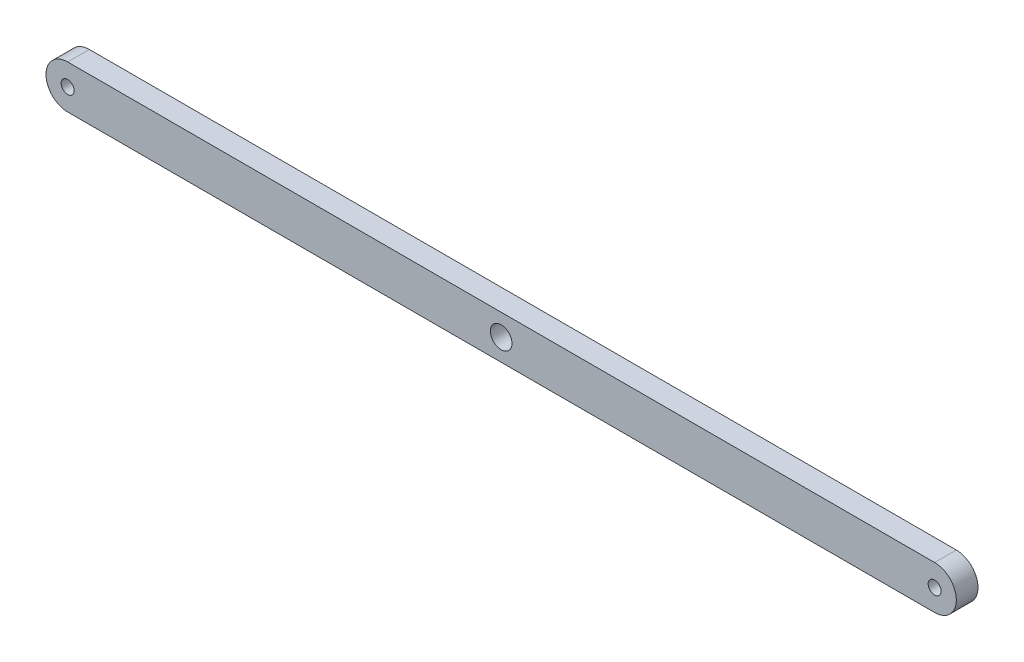
ISO-10303-21;
HEADER;
FILE_DESCRIPTION(('STEP AP214'),'2;1');
FILE_NAME('part.step','',(''),(''),'','','');
FILE_SCHEMA(('AUTOMOTIVE_DESIGN { 1 0 10303 214 1 1 1 1 }'));
ENDSEC;
DATA;
#1=APPLICATION_CONTEXT('core data for automotive mechanical design processes');
#2=APPLICATION_PROTOCOL_DEFINITION('international standard','automotive_design',2000,#1);
#3=PRODUCT_CONTEXT('',#1,'mechanical');
#4=PRODUCT('Part','Part','',(#3));
#5=PRODUCT_RELATED_PRODUCT_CATEGORY('part','',(#4));
#6=PRODUCT_DEFINITION_FORMATION('','',#4);
#7=PRODUCT_DEFINITION_CONTEXT('part definition',#1,'design');
#8=PRODUCT_DEFINITION('design','',#6,#7);
#9=PRODUCT_DEFINITION_SHAPE('','',#8);
#10=(LENGTH_UNIT() NAMED_UNIT(*) SI_UNIT(.MILLI.,.METRE.));
#11=(NAMED_UNIT(*) PLANE_ANGLE_UNIT() SI_UNIT($,.RADIAN.));
#12=(NAMED_UNIT(*) SI_UNIT($,.STERADIAN.) SOLID_ANGLE_UNIT());
#13=UNCERTAINTY_MEASURE_WITH_UNIT(LENGTH_MEASURE(1.E-05),#10,'distance_accuracy_value','');
#14=(GEOMETRIC_REPRESENTATION_CONTEXT(3) GLOBAL_UNCERTAINTY_ASSIGNED_CONTEXT((#13)) GLOBAL_UNIT_ASSIGNED_CONTEXT((#10,
#11,#12)) REPRESENTATION_CONTEXT('',''));
#15=CARTESIAN_POINT('',(0.,0.,0.));
#16=DIRECTION('',(0.,0.,1.));
#17=DIRECTION('',(1.,0.,0.));
#18=AXIS2_PLACEMENT_3D('',#15,#16,#17);
#19=CARTESIAN_POINT('',(-1000.,0.,25.));
#20=DIRECTION('',(0.,0.,-1.));
#21=DIRECTION('',(-1.,0.,0.));
#22=AXIS2_PLACEMENT_3D('',#19,#20,#21);
#23=CYLINDRICAL_SURFACE('',#22,50.);
#24=CARTESIAN_POINT('',(-1000.,0.,-25.));
#25=DIRECTION('',(0.,0.,1.));
#26=DIRECTION('',(1.,0.,0.));
#27=AXIS2_PLACEMENT_3D('',#24,#25,#26);
#28=CIRCLE('',#27,50.);
#29=CARTESIAN_POINT('',(-1000.,49.9999999999999,-25.));
#30=VERTEX_POINT('',#29);
#31=CARTESIAN_POINT('',(-1000.,-50.0000000000001,-25.));
#32=VERTEX_POINT('',#31);
#33=EDGE_CURVE('E100',#30,#32,#28,.T.);
#34=ORIENTED_EDGE('',*,*,#33,.T.);
#35=DIRECTION('',(0.,0.,-1.));
#36=VECTOR('',#35,1.);
#37=CARTESIAN_POINT('',(-1000.,-50.0000000000001,25.));
#38=LINE('',#37,#36);
#39=CARTESIAN_POINT('',(-1000.,-50.0000000000001,25.));
#40=VERTEX_POINT('',#39);
#41=EDGE_CURVE('E11',#40,#32,#38,.T.);
#42=ORIENTED_EDGE('',*,*,#41,.F.);
#43=CARTESIAN_POINT('',(-1000.,0.,25.));
#44=DIRECTION('',(0.,0.,1.));
#45=DIRECTION('',(1.,0.,0.));
#46=AXIS2_PLACEMENT_3D('',#43,#44,#45);
#47=CIRCLE('',#46,50.);
#48=CARTESIAN_POINT('',(-1000.,49.9999999999999,25.));
#49=VERTEX_POINT('',#48);
#50=EDGE_CURVE('E88',#49,#40,#47,.T.);
#51=ORIENTED_EDGE('',*,*,#50,.F.);
#52=DIRECTION('',(0.,0.,-1.));
#53=VECTOR('',#52,1.);
#54=CARTESIAN_POINT('',(-1000.,49.9999999999999,25.));
#55=LINE('',#54,#53);
#56=EDGE_CURVE('E96',#49,#30,#55,.T.);
#57=ORIENTED_EDGE('',*,*,#56,.T.);
#58=EDGE_LOOP('',(#34,#42,#51,#57));
#59=FACE_BOUND('',#58,.T.);
#60=ADVANCED_FACE('F37',(#59),#23,.T.);
#61=CARTESIAN_POINT('',(-1000.,-50.0000000000001,25.));
#62=DIRECTION('',(0.,1.,0.));
#63=DIRECTION('',(0.,0.,1.));
#64=AXIS2_PLACEMENT_3D('',#61,#62,#63);
#65=PLANE('',#64);
#66=DIRECTION('',(1.,0.,0.));
#67=VECTOR('',#66,1.);
#68=CARTESIAN_POINT('',(-1000.,-50.0000000000001,-25.));
#69=LINE('',#68,#67);
#70=CARTESIAN_POINT('',(1000.,-50.0000000000002,-25.));
#71=VERTEX_POINT('',#70);
#72=EDGE_CURVE('E92',#32,#71,#69,.T.);
#73=ORIENTED_EDGE('',*,*,#72,.T.);
#74=DIRECTION('',(0.,0.,-1.));
#75=VECTOR('',#74,1.);
#76=CARTESIAN_POINT('',(1000.,-50.0000000000002,25.));
#77=LINE('',#76,#75);
#78=CARTESIAN_POINT('',(1000.,-50.0000000000002,25.));
#79=VERTEX_POINT('',#78);
#80=EDGE_CURVE('E45',#79,#71,#77,.T.);
#81=ORIENTED_EDGE('',*,*,#80,.F.);
#82=DIRECTION('',(1.,0.,0.));
#83=VECTOR('',#82,1.);
#84=CARTESIAN_POINT('',(-1000.,-50.0000000000001,25.));
#85=LINE('',#84,#83);
#86=EDGE_CURVE('E83',#40,#79,#85,.T.);
#87=ORIENTED_EDGE('',*,*,#86,.F.);
#88=ORIENTED_EDGE('',*,*,#41,.T.);
#89=EDGE_LOOP('',(#73,#81,#87,#88));
#90=FACE_BOUND('',#89,.T.);
#91=ADVANCED_FACE('F91',(#90),#65,.F.);
#92=CARTESIAN_POINT('',(1000.,0.,25.));
#93=DIRECTION('',(0.,0.,-1.));
#94=DIRECTION('',(-1.,0.,0.));
#95=AXIS2_PLACEMENT_3D('',#92,#93,#94);
#96=CYLINDRICAL_SURFACE('',#95,50.0000000000002);
#97=CARTESIAN_POINT('',(1000.,0.,-25.));
#98=DIRECTION('',(0.,0.,1.));
#99=DIRECTION('',(1.,0.,0.));
#100=AXIS2_PLACEMENT_3D('',#97,#98,#99);
#101=CIRCLE('',#100,50.0000000000002);
#102=CARTESIAN_POINT('',(1000.,50.0000000000003,-25.));
#103=VERTEX_POINT('',#102);
#104=EDGE_CURVE('E70',#71,#103,#101,.T.);
#105=ORIENTED_EDGE('',*,*,#104,.T.);
#106=DIRECTION('',(0.,0.,-1.));
#107=VECTOR('',#106,1.);
#108=CARTESIAN_POINT('',(1000.,50.0000000000003,25.));
#109=LINE('',#108,#107);
#110=CARTESIAN_POINT('',(1000.,50.0000000000003,25.));
#111=VERTEX_POINT('',#110);
#112=EDGE_CURVE('E93',#111,#103,#109,.T.);
#113=ORIENTED_EDGE('',*,*,#112,.F.);
#114=CARTESIAN_POINT('',(1000.,0.,25.));
#115=DIRECTION('',(0.,0.,1.));
#116=DIRECTION('',(1.,0.,0.));
#117=AXIS2_PLACEMENT_3D('',#114,#115,#116);
#118=CIRCLE('',#117,50.0000000000002);
#119=EDGE_CURVE('E86',#79,#111,#118,.T.);
#120=ORIENTED_EDGE('',*,*,#119,.F.);
#121=ORIENTED_EDGE('',*,*,#80,.T.);
#122=EDGE_LOOP('',(#105,#113,#120,#121));
#123=FACE_BOUND('',#122,.T.);
#124=ADVANCED_FACE('F94',(#123),#96,.T.);
#125=CARTESIAN_POINT('',(-1000.,49.9999999999999,25.));
#126=DIRECTION('',(0.,-1.,0.));
#127=DIRECTION('',(1.,0.,0.));
#128=AXIS2_PLACEMENT_3D('',#125,#126,#127);
#129=PLANE('',#128);
#130=DIRECTION('',(-1.,0.,0.));
#131=VECTOR('',#130,1.);
#132=CARTESIAN_POINT('',(-1000.,49.9999999999999,-25.));
#133=LINE('',#132,#131);
#134=EDGE_CURVE('E76',#103,#30,#133,.T.);
#135=ORIENTED_EDGE('',*,*,#134,.T.);
#136=ORIENTED_EDGE('',*,*,#56,.F.);
#137=DIRECTION('',(-1.,0.,0.));
#138=VECTOR('',#137,1.);
#139=CARTESIAN_POINT('',(-1000.,49.9999999999999,25.));
#140=LINE('',#139,#138);
#141=EDGE_CURVE('E53',#111,#49,#140,.T.);
#142=ORIENTED_EDGE('',*,*,#141,.F.);
#143=ORIENTED_EDGE('',*,*,#112,.T.);
#144=EDGE_LOOP('',(#135,#136,#142,#143));
#145=FACE_BOUND('',#144,.T.);
#146=ADVANCED_FACE('F108',(#145),#129,.F.);
#147=CARTESIAN_POINT('',(-1000.,0.,25.));
#148=DIRECTION('',(0.,0.,1.));
#149=DIRECTION('',(1.,0.,0.));
#150=AXIS2_PLACEMENT_3D('',#147,#148,#149);
#151=PLANE('',#150);
#152=CARTESIAN_POINT('',(0.,0.,25.));
#153=DIRECTION('',(0.,0.,1.));
#154=DIRECTION('',(1.,0.,0.));
#155=AXIS2_PLACEMENT_3D('',#152,#153,#154);
#156=CIRCLE('',#155,25.);
#157=CARTESIAN_POINT('',(25.,0.,25.));
#158=VERTEX_POINT('',#157);
#159=EDGE_CURVE('E128',#158,#158,#156,.T.);
#160=ORIENTED_EDGE('',*,*,#159,.F.);
#161=EDGE_LOOP('',(#160));
#162=FACE_BOUND('',#161,.T.);
#163=CARTESIAN_POINT('',(-1000.,0.,25.));
#164=DIRECTION('',(0.,0.,1.));
#165=DIRECTION('',(1.,0.,0.));
#166=AXIS2_PLACEMENT_3D('',#163,#164,#165);
#167=CIRCLE('',#166,15.0000000000001);
#168=CARTESIAN_POINT('',(-985.,0.,25.));
#169=VERTEX_POINT('',#168);
#170=EDGE_CURVE('E121',#169,#169,#167,.T.);
#171=ORIENTED_EDGE('',*,*,#170,.F.);
#172=EDGE_LOOP('',(#171));
#173=FACE_BOUND('',#172,.T.);
#174=CARTESIAN_POINT('',(1000.,0.,25.));
#175=DIRECTION('',(0.,0.,1.));
#176=DIRECTION('',(1.,0.,0.));
#177=AXIS2_PLACEMENT_3D('',#174,#175,#176);
#178=CIRCLE('',#177,15.0000000000001);
#179=CARTESIAN_POINT('',(1015.,0.,25.));
#180=VERTEX_POINT('',#179);
#181=EDGE_CURVE('E117',#180,#180,#178,.T.);
#182=ORIENTED_EDGE('',*,*,#181,.F.);
#183=EDGE_LOOP('',(#182));
#184=FACE_BOUND('',#183,.T.);
#185=ORIENTED_EDGE('',*,*,#50,.T.);
#186=ORIENTED_EDGE('',*,*,#86,.T.);
#187=ORIENTED_EDGE('',*,*,#119,.T.);
#188=ORIENTED_EDGE('',*,*,#141,.T.);
#189=EDGE_LOOP('',(#185,#186,#187,#188));
#190=FACE_BOUND('',#189,.T.);
#191=ADVANCED_FACE('F84',(#162,#173,#184,#190),#151,.T.);
#192=CARTESIAN_POINT('',(-1000.,0.,-25.));
#193=DIRECTION('',(0.,0.,1.));
#194=DIRECTION('',(1.,0.,0.));
#195=AXIS2_PLACEMENT_3D('',#192,#193,#194);
#196=PLANE('',#195);
#197=CARTESIAN_POINT('',(0.,0.,-25.));
#198=DIRECTION('',(0.,0.,1.));
#199=DIRECTION('',(1.,0.,0.));
#200=AXIS2_PLACEMENT_3D('',#197,#198,#199);
#201=CIRCLE('',#200,25.);
#202=CARTESIAN_POINT('',(25.,0.,-25.));
#203=VERTEX_POINT('',#202);
#204=EDGE_CURVE('E118',#203,#203,#201,.T.);
#205=ORIENTED_EDGE('',*,*,#204,.T.);
#206=EDGE_LOOP('',(#205));
#207=FACE_BOUND('',#206,.T.);
#208=CARTESIAN_POINT('',(-1000.,0.,-25.));
#209=DIRECTION('',(0.,0.,1.));
#210=DIRECTION('',(1.,0.,0.));
#211=AXIS2_PLACEMENT_3D('',#208,#209,#210);
#212=CIRCLE('',#211,15.0000000000001);
#213=CARTESIAN_POINT('',(-985.,0.,-25.));
#214=VERTEX_POINT('',#213);
#215=EDGE_CURVE('E103',#214,#214,#212,.T.);
#216=ORIENTED_EDGE('',*,*,#215,.T.);
#217=EDGE_LOOP('',(#216));
#218=FACE_BOUND('',#217,.T.);
#219=CARTESIAN_POINT('',(1000.,0.,-25.));
#220=DIRECTION('',(0.,0.,1.));
#221=DIRECTION('',(1.,0.,0.));
#222=AXIS2_PLACEMENT_3D('',#219,#220,#221);
#223=CIRCLE('',#222,15.0000000000001);
#224=CARTESIAN_POINT('',(1015.,0.,-25.));
#225=VERTEX_POINT('',#224);
#226=EDGE_CURVE('E114',#225,#225,#223,.T.);
#227=ORIENTED_EDGE('',*,*,#226,.T.);
#228=EDGE_LOOP('',(#227));
#229=FACE_BOUND('',#228,.T.);
#230=ORIENTED_EDGE('',*,*,#33,.F.);
#231=ORIENTED_EDGE('',*,*,#134,.F.);
#232=ORIENTED_EDGE('',*,*,#104,.F.);
#233=ORIENTED_EDGE('',*,*,#72,.F.);
#234=EDGE_LOOP('',(#230,#231,#232,#233));
#235=FACE_BOUND('',#234,.T.);
#236=ADVANCED_FACE('F111',(#207,#218,#229,#235),#196,.F.);
#237=CARTESIAN_POINT('',(1000.,0.,-25.));
#238=DIRECTION('',(0.,0.,1.));
#239=DIRECTION('',(1.,0.,0.));
#240=AXIS2_PLACEMENT_3D('',#237,#238,#239);
#241=CYLINDRICAL_SURFACE('',#240,15.0000000000001);
#242=ORIENTED_EDGE('',*,*,#226,.F.);
#243=EDGE_LOOP('',(#242));
#244=FACE_BOUND('',#243,.T.);
#245=ORIENTED_EDGE('',*,*,#181,.T.);
#246=EDGE_LOOP('',(#245));
#247=FACE_BOUND('',#246,.T.);
#248=ADVANCED_FACE('F141',(#244,#247),#241,.F.);
#249=CARTESIAN_POINT('',(-1000.,0.,-25.));
#250=DIRECTION('',(0.,0.,1.));
#251=DIRECTION('',(1.,0.,0.));
#252=AXIS2_PLACEMENT_3D('',#249,#250,#251);
#253=CYLINDRICAL_SURFACE('',#252,15.0000000000001);
#254=ORIENTED_EDGE('',*,*,#215,.F.);
#255=EDGE_LOOP('',(#254));
#256=FACE_BOUND('',#255,.T.);
#257=ORIENTED_EDGE('',*,*,#170,.T.);
#258=EDGE_LOOP('',(#257));
#259=FACE_BOUND('',#258,.T.);
#260=ADVANCED_FACE('F143',(#256,#259),#253,.F.);
#261=CARTESIAN_POINT('',(0.,0.,-25.));
#262=DIRECTION('',(0.,0.,1.));
#263=DIRECTION('',(1.,0.,0.));
#264=AXIS2_PLACEMENT_3D('',#261,#262,#263);
#265=CYLINDRICAL_SURFACE('',#264,25.);
#266=ORIENTED_EDGE('',*,*,#204,.F.);
#267=EDGE_LOOP('',(#266));
#268=FACE_BOUND('',#267,.T.);
#269=ORIENTED_EDGE('',*,*,#159,.T.);
#270=EDGE_LOOP('',(#269));
#271=FACE_BOUND('',#270,.T.);
#272=ADVANCED_FACE('F132',(#268,#271),#265,.F.);
#273=CLOSED_SHELL('',(#60,#91,#124,#146,#191,#236,#248,#260,#272));
#274=MANIFOLD_SOLID_BREP('B2',#273);
#275=ADVANCED_BREP_SHAPE_REPRESENTATION('',(#18,#274),#14);
#276=SHAPE_DEFINITION_REPRESENTATION(#9,#275);
ENDSEC;
END-ISO-10303-21;
